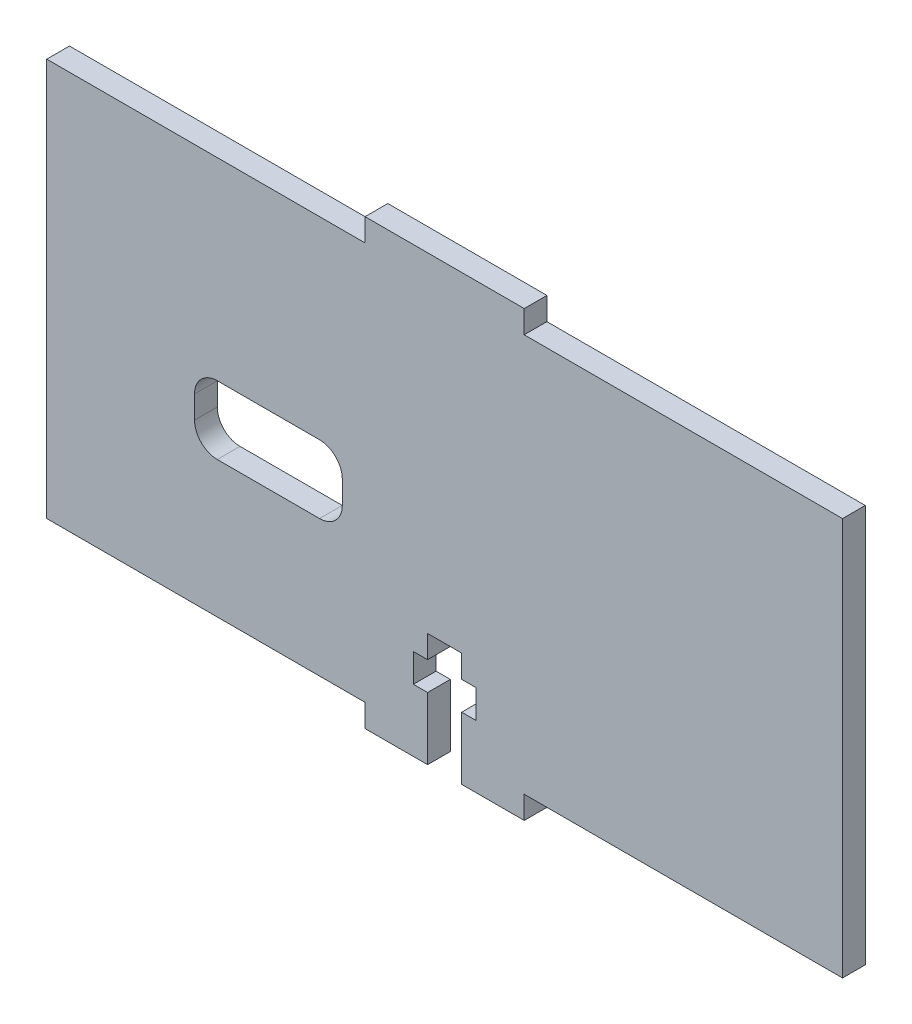
ISO-10303-21;
HEADER;
FILE_DESCRIPTION(('STEP AP214'),'2;1');
FILE_NAME('part.step','',(''),(''),'','','');
FILE_SCHEMA(('AUTOMOTIVE_DESIGN { 1 0 10303 214 1 1 1 1 }'));
ENDSEC;
DATA;
#1=APPLICATION_CONTEXT('core data for automotive mechanical design processes');
#2=APPLICATION_PROTOCOL_DEFINITION('international standard','automotive_design',2000,#1);
#3=PRODUCT_CONTEXT('',#1,'mechanical');
#4=PRODUCT('Part','Part','',(#3));
#5=PRODUCT_RELATED_PRODUCT_CATEGORY('part','',(#4));
#6=PRODUCT_DEFINITION_FORMATION('','',#4);
#7=PRODUCT_DEFINITION_CONTEXT('part definition',#1,'design');
#8=PRODUCT_DEFINITION('design','',#6,#7);
#9=PRODUCT_DEFINITION_SHAPE('','',#8);
#10=(LENGTH_UNIT() NAMED_UNIT(*) SI_UNIT(.MILLI.,.METRE.));
#11=(NAMED_UNIT(*) PLANE_ANGLE_UNIT() SI_UNIT($,.RADIAN.));
#12=(NAMED_UNIT(*) SI_UNIT($,.STERADIAN.) SOLID_ANGLE_UNIT());
#13=UNCERTAINTY_MEASURE_WITH_UNIT(LENGTH_MEASURE(1.E-05),#10,'distance_accuracy_value','');
#14=(GEOMETRIC_REPRESENTATION_CONTEXT(3) GLOBAL_UNCERTAINTY_ASSIGNED_CONTEXT((#13)) GLOBAL_UNIT_ASSIGNED_CONTEXT((#10,
#11,#12)) REPRESENTATION_CONTEXT('',''));
#15=CARTESIAN_POINT('',(0.,0.,0.));
#16=DIRECTION('',(0.,0.,1.));
#17=DIRECTION('',(1.,0.,0.));
#18=AXIS2_PLACEMENT_3D('',#15,#16,#17);
#19=CARTESIAN_POINT('',(0.,0.,2.));
#20=DIRECTION('',(0.,0.,-1.));
#21=DIRECTION('',(-1.,0.,0.));
#22=AXIS2_PLACEMENT_3D('',#19,#20,#21);
#23=PLANE('',#22);
#24=DIRECTION('',(0.,-1.,0.));
#25=VECTOR('',#24,1.);
#26=CARTESIAN_POINT('',(0.,0.,2.));
#27=LINE('',#26,#25);
#28=CARTESIAN_POINT('',(0.,35.,2.));
#29=VERTEX_POINT('',#28);
#30=CARTESIAN_POINT('',(0.,0.,2.));
#31=VERTEX_POINT('',#30);
#32=EDGE_CURVE('E253',#29,#31,#27,.T.);
#33=ORIENTED_EDGE('',*,*,#32,.T.);
#34=DIRECTION('',(1.,0.,0.));
#35=VECTOR('',#34,1.);
#36=CARTESIAN_POINT('',(0.,0.,2.));
#37=LINE('',#36,#35);
#38=CARTESIAN_POINT('',(28.,0.,2.));
#39=VERTEX_POINT('',#38);
#40=EDGE_CURVE('E242',#31,#39,#37,.T.);
#41=ORIENTED_EDGE('',*,*,#40,.T.);
#42=DIRECTION('',(0.,-1.,0.));
#43=VECTOR('',#42,1.);
#44=CARTESIAN_POINT('',(28.,0.,2.));
#45=LINE('',#44,#43);
#46=CARTESIAN_POINT('',(28.,-2.,2.));
#47=VERTEX_POINT('',#46);
#48=EDGE_CURVE('E252',#39,#47,#45,.T.);
#49=ORIENTED_EDGE('',*,*,#48,.T.);
#50=DIRECTION('',(1.,0.,0.));
#51=VECTOR('',#50,1.);
#52=CARTESIAN_POINT('',(28.,-2.,2.));
#53=LINE('',#52,#51);
#54=CARTESIAN_POINT('',(33.5,-2.,2.));
#55=VERTEX_POINT('',#54);
#56=EDGE_CURVE('E337',#47,#55,#53,.T.);
#57=ORIENTED_EDGE('',*,*,#56,.T.);
#58=DIRECTION('',(0.,1.,0.));
#59=VECTOR('',#58,1.);
#60=CARTESIAN_POINT('',(33.5,-2.,2.));
#61=LINE('',#60,#59);
#62=CARTESIAN_POINT('',(33.5,3.5,2.));
#63=VERTEX_POINT('',#62);
#64=EDGE_CURVE('E339',#55,#63,#61,.T.);
#65=ORIENTED_EDGE('',*,*,#64,.T.);
#66=DIRECTION('',(-1.,0.,0.));
#67=VECTOR('',#66,1.);
#68=CARTESIAN_POINT('',(33.5,3.5,2.));
#69=LINE('',#68,#67);
#70=CARTESIAN_POINT('',(32.25,3.5,2.));
#71=VERTEX_POINT('',#70);
#72=EDGE_CURVE('E341',#63,#71,#69,.T.);
#73=ORIENTED_EDGE('',*,*,#72,.T.);
#74=DIRECTION('',(0.,1.,0.));
#75=VECTOR('',#74,1.);
#76=CARTESIAN_POINT('',(32.25,3.5,2.));
#77=LINE('',#76,#75);
#78=CARTESIAN_POINT('',(32.25,6.,2.));
#79=VERTEX_POINT('',#78);
#80=EDGE_CURVE('E343',#71,#79,#77,.T.);
#81=ORIENTED_EDGE('',*,*,#80,.T.);
#82=DIRECTION('',(1.,0.,0.));
#83=VECTOR('',#82,1.);
#84=CARTESIAN_POINT('',(32.25,6.,2.));
#85=LINE('',#84,#83);
#86=CARTESIAN_POINT('',(33.5,6.,2.));
#87=VERTEX_POINT('',#86);
#88=EDGE_CURVE('E345',#79,#87,#85,.T.);
#89=ORIENTED_EDGE('',*,*,#88,.T.);
#90=DIRECTION('',(0.,1.,0.));
#91=VECTOR('',#90,1.);
#92=CARTESIAN_POINT('',(33.5,6.,2.));
#93=LINE('',#92,#91);
#94=CARTESIAN_POINT('',(33.5,8.,2.));
#95=VERTEX_POINT('',#94);
#96=EDGE_CURVE('E347',#87,#95,#93,.T.);
#97=ORIENTED_EDGE('',*,*,#96,.T.);
#98=DIRECTION('',(1.,0.,0.));
#99=VECTOR('',#98,1.);
#100=CARTESIAN_POINT('',(33.5,8.,2.));
#101=LINE('',#100,#99);
#102=CARTESIAN_POINT('',(36.5,8.,2.));
#103=VERTEX_POINT('',#102);
#104=EDGE_CURVE('E349',#95,#103,#101,.T.);
#105=ORIENTED_EDGE('',*,*,#104,.T.);
#106=DIRECTION('',(0.,-1.,0.));
#107=VECTOR('',#106,1.);
#108=CARTESIAN_POINT('',(36.5,8.,2.));
#109=LINE('',#108,#107);
#110=CARTESIAN_POINT('',(36.5,6.,2.));
#111=VERTEX_POINT('',#110);
#112=EDGE_CURVE('E351',#103,#111,#109,.T.);
#113=ORIENTED_EDGE('',*,*,#112,.T.);
#114=DIRECTION('',(1.,0.,0.));
#115=VECTOR('',#114,1.);
#116=CARTESIAN_POINT('',(36.5,6.,2.));
#117=LINE('',#116,#115);
#118=CARTESIAN_POINT('',(37.75,6.,2.));
#119=VERTEX_POINT('',#118);
#120=EDGE_CURVE('E353',#111,#119,#117,.T.);
#121=ORIENTED_EDGE('',*,*,#120,.T.);
#122=DIRECTION('',(0.,-1.,0.));
#123=VECTOR('',#122,1.);
#124=CARTESIAN_POINT('',(37.75,6.,2.));
#125=LINE('',#124,#123);
#126=CARTESIAN_POINT('',(37.75,3.5,2.));
#127=VERTEX_POINT('',#126);
#128=EDGE_CURVE('E355',#119,#127,#125,.T.);
#129=ORIENTED_EDGE('',*,*,#128,.T.);
#130=DIRECTION('',(-1.,0.,0.));
#131=VECTOR('',#130,1.);
#132=CARTESIAN_POINT('',(37.75,3.5,2.));
#133=LINE('',#132,#131);
#134=CARTESIAN_POINT('',(36.5,3.5,2.));
#135=VERTEX_POINT('',#134);
#136=EDGE_CURVE('E357',#127,#135,#133,.T.);
#137=ORIENTED_EDGE('',*,*,#136,.T.);
#138=DIRECTION('',(0.,-1.,0.));
#139=VECTOR('',#138,1.);
#140=CARTESIAN_POINT('',(36.5,3.5,2.));
#141=LINE('',#140,#139);
#142=CARTESIAN_POINT('',(36.5,-2.,2.));
#143=VERTEX_POINT('',#142);
#144=EDGE_CURVE('E359',#135,#143,#141,.T.);
#145=ORIENTED_EDGE('',*,*,#144,.T.);
#146=DIRECTION('',(1.,0.,0.));
#147=VECTOR('',#146,1.);
#148=CARTESIAN_POINT('',(36.5,-2.,2.));
#149=LINE('',#148,#147);
#150=CARTESIAN_POINT('',(42.,-2.,2.));
#151=VERTEX_POINT('',#150);
#152=EDGE_CURVE('E361',#143,#151,#149,.T.);
#153=ORIENTED_EDGE('',*,*,#152,.T.);
#154=DIRECTION('',(0.,1.,0.));
#155=VECTOR('',#154,1.);
#156=CARTESIAN_POINT('',(42.,0.,2.));
#157=LINE('',#156,#155);
#158=CARTESIAN_POINT('',(42.,0.,2.));
#159=VERTEX_POINT('',#158);
#160=EDGE_CURVE('E363',#151,#159,#157,.T.);
#161=ORIENTED_EDGE('',*,*,#160,.T.);
#162=DIRECTION('',(1.,0.,0.));
#163=VECTOR('',#162,1.);
#164=CARTESIAN_POINT('',(42.,0.,2.));
#165=LINE('',#164,#163);
#166=CARTESIAN_POINT('',(70.,0.,2.));
#167=VERTEX_POINT('',#166);
#168=EDGE_CURVE('E365',#159,#167,#165,.T.);
#169=ORIENTED_EDGE('',*,*,#168,.T.);
#170=DIRECTION('',(0.,1.,0.));
#171=VECTOR('',#170,1.);
#172=CARTESIAN_POINT('',(70.,0.,2.));
#173=LINE('',#172,#171);
#174=CARTESIAN_POINT('',(70.,35.,2.));
#175=VERTEX_POINT('',#174);
#176=EDGE_CURVE('E367',#167,#175,#173,.T.);
#177=ORIENTED_EDGE('',*,*,#176,.T.);
#178=DIRECTION('',(-1.,0.,0.));
#179=VECTOR('',#178,1.);
#180=CARTESIAN_POINT('',(42.,35.,2.));
#181=LINE('',#180,#179);
#182=CARTESIAN_POINT('',(42.,35.,2.));
#183=VERTEX_POINT('',#182);
#184=EDGE_CURVE('E369',#175,#183,#181,.T.);
#185=ORIENTED_EDGE('',*,*,#184,.T.);
#186=DIRECTION('',(0.,1.,0.));
#187=VECTOR('',#186,1.);
#188=CARTESIAN_POINT('',(42.,35.,2.));
#189=LINE('',#188,#187);
#190=CARTESIAN_POINT('',(42.,37.,2.));
#191=VERTEX_POINT('',#190);
#192=EDGE_CURVE('E371',#183,#191,#189,.T.);
#193=ORIENTED_EDGE('',*,*,#192,.T.);
#194=DIRECTION('',(-1.,0.,0.));
#195=VECTOR('',#194,1.);
#196=CARTESIAN_POINT('',(28.,37.,2.));
#197=LINE('',#196,#195);
#198=CARTESIAN_POINT('',(28.,37.,2.));
#199=VERTEX_POINT('',#198);
#200=EDGE_CURVE('E373',#191,#199,#197,.T.);
#201=ORIENTED_EDGE('',*,*,#200,.T.);
#202=DIRECTION('',(0.,-1.,0.));
#203=VECTOR('',#202,1.);
#204=CARTESIAN_POINT('',(28.,35.,2.));
#205=LINE('',#204,#203);
#206=CARTESIAN_POINT('',(28.,35.,2.));
#207=VERTEX_POINT('',#206);
#208=EDGE_CURVE('E375',#199,#207,#205,.T.);
#209=ORIENTED_EDGE('',*,*,#208,.T.);
#210=DIRECTION('',(-1.,0.,0.));
#211=VECTOR('',#210,1.);
#212=CARTESIAN_POINT('',(0.,35.,2.));
#213=LINE('',#212,#211);
#214=EDGE_CURVE('E257',#207,#29,#213,.T.);
#215=ORIENTED_EDGE('',*,*,#214,.T.);
#216=EDGE_LOOP('',(#33,#41,#49,#57,#65,#73,#81,#89,#97,#105,#113,#121,#129,#137,#145,#153,#161,
#169,#177,#185,#193,#201,#209,#215));
#217=FACE_BOUND('',#216,.T.);
#218=DIRECTION('',(0.,1.,0.));
#219=VECTOR('',#218,1.);
#220=CARTESIAN_POINT('',(26.,18.,2.));
#221=LINE('',#220,#219);
#222=CARTESIAN_POINT('',(26.,14.,2.));
#223=VERTEX_POINT('',#222);
#224=CARTESIAN_POINT('',(26.,16.,2.));
#225=VERTEX_POINT('',#224);
#226=EDGE_CURVE('E321',#223,#225,#221,.T.);
#227=ORIENTED_EDGE('',*,*,#226,.F.);
#228=CARTESIAN_POINT('',(24.,14.,2.));
#229=DIRECTION('',(0.,0.,-1.));
#230=DIRECTION('',(-1.,0.,0.));
#231=AXIS2_PLACEMENT_3D('',#228,#229,#230);
#232=CIRCLE('',#231,2.);
#233=CARTESIAN_POINT('',(24.,12.,2.));
#234=VERTEX_POINT('',#233);
#235=EDGE_CURVE('E296',#223,#234,#232,.T.);
#236=ORIENTED_EDGE('',*,*,#235,.T.);
#237=DIRECTION('',(1.,0.,0.));
#238=VECTOR('',#237,1.);
#239=CARTESIAN_POINT('',(13.,12.,2.));
#240=LINE('',#239,#238);
#241=CARTESIAN_POINT('',(15.,12.,2.));
#242=VERTEX_POINT('',#241);
#243=EDGE_CURVE('E323',#242,#234,#240,.T.);
#244=ORIENTED_EDGE('',*,*,#243,.F.);
#245=CARTESIAN_POINT('',(15.,14.,2.));
#246=DIRECTION('',(0.,0.,-1.));
#247=DIRECTION('',(-1.,0.,0.));
#248=AXIS2_PLACEMENT_3D('',#245,#246,#247);
#249=CIRCLE('',#248,2.);
#250=CARTESIAN_POINT('',(13.,14.,2.));
#251=VERTEX_POINT('',#250);
#252=EDGE_CURVE('E292',#242,#251,#249,.T.);
#253=ORIENTED_EDGE('',*,*,#252,.T.);
#254=DIRECTION('',(0.,-1.,0.));
#255=VECTOR('',#254,1.);
#256=CARTESIAN_POINT('',(13.,18.,2.));
#257=LINE('',#256,#255);
#258=CARTESIAN_POINT('',(13.,16.,2.));
#259=VERTEX_POINT('',#258);
#260=EDGE_CURVE('E320',#259,#251,#257,.T.);
#261=ORIENTED_EDGE('',*,*,#260,.F.);
#262=CARTESIAN_POINT('',(15.,16.,2.));
#263=DIRECTION('',(0.,0.,-1.));
#264=DIRECTION('',(-1.,0.,0.));
#265=AXIS2_PLACEMENT_3D('',#262,#263,#264);
#266=CIRCLE('',#265,2.);
#267=CARTESIAN_POINT('',(15.,18.,2.));
#268=VERTEX_POINT('',#267);
#269=EDGE_CURVE('E11',#259,#268,#266,.T.);
#270=ORIENTED_EDGE('',*,*,#269,.T.);
#271=DIRECTION('',(-1.,0.,0.));
#272=VECTOR('',#271,1.);
#273=CARTESIAN_POINT('',(13.,18.,2.));
#274=LINE('',#273,#272);
#275=CARTESIAN_POINT('',(24.,18.,2.));
#276=VERTEX_POINT('',#275);
#277=EDGE_CURVE('E318',#276,#268,#274,.T.);
#278=ORIENTED_EDGE('',*,*,#277,.F.);
#279=CARTESIAN_POINT('',(24.,16.,2.));
#280=DIRECTION('',(0.,0.,-1.));
#281=DIRECTION('',(-1.,0.,0.));
#282=AXIS2_PLACEMENT_3D('',#279,#280,#281);
#283=CIRCLE('',#282,2.);
#284=EDGE_CURVE('E300',#276,#225,#283,.T.);
#285=ORIENTED_EDGE('',*,*,#284,.T.);
#286=EDGE_LOOP('',(#227,#236,#244,#253,#261,#270,#278,#285));
#287=FACE_BOUND('',#286,.T.);
#288=ADVANCED_FACE('F33',(#217,#287),#23,.F.);
#289=CARTESIAN_POINT('',(0.,0.,0.));
#290=DIRECTION('',(0.,0.,-1.));
#291=DIRECTION('',(-1.,0.,0.));
#292=AXIS2_PLACEMENT_3D('',#289,#290,#291);
#293=PLANE('',#292);
#294=DIRECTION('',(0.,-1.,0.));
#295=VECTOR('',#294,1.);
#296=CARTESIAN_POINT('',(0.,0.,0.));
#297=LINE('',#296,#295);
#298=CARTESIAN_POINT('',(0.,35.,0.));
#299=VERTEX_POINT('',#298);
#300=CARTESIAN_POINT('',(0.,0.,0.));
#301=VERTEX_POINT('',#300);
#302=EDGE_CURVE('E265',#299,#301,#297,.T.);
#303=ORIENTED_EDGE('',*,*,#302,.F.);
#304=DIRECTION('',(-1.,0.,0.));
#305=VECTOR('',#304,1.);
#306=CARTESIAN_POINT('',(0.,35.,0.));
#307=LINE('',#306,#305);
#308=CARTESIAN_POINT('',(28.,35.,0.));
#309=VERTEX_POINT('',#308);
#310=EDGE_CURVE('E261',#309,#299,#307,.T.);
#311=ORIENTED_EDGE('',*,*,#310,.F.);
#312=DIRECTION('',(0.,-1.,0.));
#313=VECTOR('',#312,1.);
#314=CARTESIAN_POINT('',(28.,35.,0.));
#315=LINE('',#314,#313);
#316=CARTESIAN_POINT('',(28.,37.,0.));
#317=VERTEX_POINT('',#316);
#318=EDGE_CURVE('E422',#317,#309,#315,.T.);
#319=ORIENTED_EDGE('',*,*,#318,.F.);
#320=DIRECTION('',(-1.,0.,0.));
#321=VECTOR('',#320,1.);
#322=CARTESIAN_POINT('',(28.,37.,0.));
#323=LINE('',#322,#321);
#324=CARTESIAN_POINT('',(42.,37.,0.));
#325=VERTEX_POINT('',#324);
#326=EDGE_CURVE('E420',#325,#317,#323,.T.);
#327=ORIENTED_EDGE('',*,*,#326,.F.);
#328=DIRECTION('',(0.,1.,0.));
#329=VECTOR('',#328,1.);
#330=CARTESIAN_POINT('',(42.,35.,0.));
#331=LINE('',#330,#329);
#332=CARTESIAN_POINT('',(42.,35.,0.));
#333=VERTEX_POINT('',#332);
#334=EDGE_CURVE('E418',#333,#325,#331,.T.);
#335=ORIENTED_EDGE('',*,*,#334,.F.);
#336=DIRECTION('',(-1.,0.,0.));
#337=VECTOR('',#336,1.);
#338=CARTESIAN_POINT('',(42.,35.,0.));
#339=LINE('',#338,#337);
#340=CARTESIAN_POINT('',(70.,35.,0.));
#341=VERTEX_POINT('',#340);
#342=EDGE_CURVE('E416',#341,#333,#339,.T.);
#343=ORIENTED_EDGE('',*,*,#342,.F.);
#344=DIRECTION('',(0.,1.,0.));
#345=VECTOR('',#344,1.);
#346=CARTESIAN_POINT('',(70.,0.,0.));
#347=LINE('',#346,#345);
#348=CARTESIAN_POINT('',(70.,0.,0.));
#349=VERTEX_POINT('',#348);
#350=EDGE_CURVE('E414',#349,#341,#347,.T.);
#351=ORIENTED_EDGE('',*,*,#350,.F.);
#352=DIRECTION('',(1.,0.,0.));
#353=VECTOR('',#352,1.);
#354=CARTESIAN_POINT('',(42.,0.,0.));
#355=LINE('',#354,#353);
#356=CARTESIAN_POINT('',(42.,0.,0.));
#357=VERTEX_POINT('',#356);
#358=EDGE_CURVE('E412',#357,#349,#355,.T.);
#359=ORIENTED_EDGE('',*,*,#358,.F.);
#360=DIRECTION('',(0.,1.,0.));
#361=VECTOR('',#360,1.);
#362=CARTESIAN_POINT('',(42.,0.,0.));
#363=LINE('',#362,#361);
#364=CARTESIAN_POINT('',(42.,-2.,0.));
#365=VERTEX_POINT('',#364);
#366=EDGE_CURVE('E410',#365,#357,#363,.T.);
#367=ORIENTED_EDGE('',*,*,#366,.F.);
#368=DIRECTION('',(1.,0.,0.));
#369=VECTOR('',#368,1.);
#370=CARTESIAN_POINT('',(36.5,-2.,0.));
#371=LINE('',#370,#369);
#372=CARTESIAN_POINT('',(36.5,-2.,0.));
#373=VERTEX_POINT('',#372);
#374=EDGE_CURVE('E408',#373,#365,#371,.T.);
#375=ORIENTED_EDGE('',*,*,#374,.F.);
#376=DIRECTION('',(0.,-1.,0.));
#377=VECTOR('',#376,1.);
#378=CARTESIAN_POINT('',(36.5,3.5,0.));
#379=LINE('',#378,#377);
#380=CARTESIAN_POINT('',(36.5,3.5,0.));
#381=VERTEX_POINT('',#380);
#382=EDGE_CURVE('E406',#381,#373,#379,.T.);
#383=ORIENTED_EDGE('',*,*,#382,.F.);
#384=DIRECTION('',(-1.,0.,0.));
#385=VECTOR('',#384,1.);
#386=CARTESIAN_POINT('',(37.75,3.5,0.));
#387=LINE('',#386,#385);
#388=CARTESIAN_POINT('',(37.75,3.5,0.));
#389=VERTEX_POINT('',#388);
#390=EDGE_CURVE('E404',#389,#381,#387,.T.);
#391=ORIENTED_EDGE('',*,*,#390,.F.);
#392=DIRECTION('',(0.,-1.,0.));
#393=VECTOR('',#392,1.);
#394=CARTESIAN_POINT('',(37.75,6.,0.));
#395=LINE('',#394,#393);
#396=CARTESIAN_POINT('',(37.75,6.,0.));
#397=VERTEX_POINT('',#396);
#398=EDGE_CURVE('E402',#397,#389,#395,.T.);
#399=ORIENTED_EDGE('',*,*,#398,.F.);
#400=DIRECTION('',(1.,0.,0.));
#401=VECTOR('',#400,1.);
#402=CARTESIAN_POINT('',(36.5,6.,0.));
#403=LINE('',#402,#401);
#404=CARTESIAN_POINT('',(36.5,6.,0.));
#405=VERTEX_POINT('',#404);
#406=EDGE_CURVE('E400',#405,#397,#403,.T.);
#407=ORIENTED_EDGE('',*,*,#406,.F.);
#408=DIRECTION('',(0.,-1.,0.));
#409=VECTOR('',#408,1.);
#410=CARTESIAN_POINT('',(36.5,8.,0.));
#411=LINE('',#410,#409);
#412=CARTESIAN_POINT('',(36.5,8.,0.));
#413=VERTEX_POINT('',#412);
#414=EDGE_CURVE('E398',#413,#405,#411,.T.);
#415=ORIENTED_EDGE('',*,*,#414,.F.);
#416=DIRECTION('',(1.,0.,0.));
#417=VECTOR('',#416,1.);
#418=CARTESIAN_POINT('',(33.5,8.,0.));
#419=LINE('',#418,#417);
#420=CARTESIAN_POINT('',(33.5,8.,0.));
#421=VERTEX_POINT('',#420);
#422=EDGE_CURVE('E396',#421,#413,#419,.T.);
#423=ORIENTED_EDGE('',*,*,#422,.F.);
#424=DIRECTION('',(0.,1.,0.));
#425=VECTOR('',#424,1.);
#426=CARTESIAN_POINT('',(33.5,6.,0.));
#427=LINE('',#426,#425);
#428=CARTESIAN_POINT('',(33.5,6.,0.));
#429=VERTEX_POINT('',#428);
#430=EDGE_CURVE('E394',#429,#421,#427,.T.);
#431=ORIENTED_EDGE('',*,*,#430,.F.);
#432=DIRECTION('',(1.,0.,0.));
#433=VECTOR('',#432,1.);
#434=CARTESIAN_POINT('',(32.25,6.,0.));
#435=LINE('',#434,#433);
#436=CARTESIAN_POINT('',(32.25,6.,0.));
#437=VERTEX_POINT('',#436);
#438=EDGE_CURVE('E392',#437,#429,#435,.T.);
#439=ORIENTED_EDGE('',*,*,#438,.F.);
#440=DIRECTION('',(0.,1.,0.));
#441=VECTOR('',#440,1.);
#442=CARTESIAN_POINT('',(32.25,3.5,0.));
#443=LINE('',#442,#441);
#444=CARTESIAN_POINT('',(32.25,3.5,0.));
#445=VERTEX_POINT('',#444);
#446=EDGE_CURVE('E390',#445,#437,#443,.T.);
#447=ORIENTED_EDGE('',*,*,#446,.F.);
#448=DIRECTION('',(-1.,0.,0.));
#449=VECTOR('',#448,1.);
#450=CARTESIAN_POINT('',(33.5,3.5,0.));
#451=LINE('',#450,#449);
#452=CARTESIAN_POINT('',(33.5,3.5,0.));
#453=VERTEX_POINT('',#452);
#454=EDGE_CURVE('E388',#453,#445,#451,.T.);
#455=ORIENTED_EDGE('',*,*,#454,.F.);
#456=DIRECTION('',(0.,1.,0.));
#457=VECTOR('',#456,1.);
#458=CARTESIAN_POINT('',(33.5,-2.,0.));
#459=LINE('',#458,#457);
#460=CARTESIAN_POINT('',(33.5,-2.,0.));
#461=VERTEX_POINT('',#460);
#462=EDGE_CURVE('E386',#461,#453,#459,.T.);
#463=ORIENTED_EDGE('',*,*,#462,.F.);
#464=DIRECTION('',(1.,0.,0.));
#465=VECTOR('',#464,1.);
#466=CARTESIAN_POINT('',(28.,-2.,0.));
#467=LINE('',#466,#465);
#468=CARTESIAN_POINT('',(28.,-2.,0.));
#469=VERTEX_POINT('',#468);
#470=EDGE_CURVE('E384',#469,#461,#467,.T.);
#471=ORIENTED_EDGE('',*,*,#470,.F.);
#472=DIRECTION('',(0.,-1.,0.));
#473=VECTOR('',#472,1.);
#474=CARTESIAN_POINT('',(28.,0.,0.));
#475=LINE('',#474,#473);
#476=CARTESIAN_POINT('',(28.,0.,0.));
#477=VERTEX_POINT('',#476);
#478=EDGE_CURVE('E382',#477,#469,#475,.T.);
#479=ORIENTED_EDGE('',*,*,#478,.F.);
#480=DIRECTION('',(1.,0.,0.));
#481=VECTOR('',#480,1.);
#482=CARTESIAN_POINT('',(0.,0.,0.));
#483=LINE('',#482,#481);
#484=EDGE_CURVE('E380',#301,#477,#483,.T.);
#485=ORIENTED_EDGE('',*,*,#484,.F.);
#486=EDGE_LOOP('',(#303,#311,#319,#327,#335,#343,#351,#359,#367,#375,#383,#391,#399,#407,#415,
#423,#431,#439,#447,#455,#463,#471,#479,#485));
#487=FACE_BOUND('',#486,.T.);
#488=DIRECTION('',(0.,-1.,0.));
#489=VECTOR('',#488,1.);
#490=CARTESIAN_POINT('',(13.,18.,0.));
#491=LINE('',#490,#489);
#492=CARTESIAN_POINT('',(13.,16.,0.));
#493=VERTEX_POINT('',#492);
#494=CARTESIAN_POINT('',(13.,14.,0.));
#495=VERTEX_POINT('',#494);
#496=EDGE_CURVE('E306',#493,#495,#491,.T.);
#497=ORIENTED_EDGE('',*,*,#496,.T.);
#498=CARTESIAN_POINT('',(15.,14.,0.));
#499=DIRECTION('',(0.,0.,-1.));
#500=DIRECTION('',(-1.,0.,0.));
#501=AXIS2_PLACEMENT_3D('',#498,#499,#500);
#502=CIRCLE('',#501,2.);
#503=CARTESIAN_POINT('',(15.,12.,0.));
#504=VERTEX_POINT('',#503);
#505=EDGE_CURVE('E290',#495,#504,#502,.F.);
#506=ORIENTED_EDGE('',*,*,#505,.T.);
#507=DIRECTION('',(1.,0.,0.));
#508=VECTOR('',#507,1.);
#509=CARTESIAN_POINT('',(13.,12.,0.));
#510=LINE('',#509,#508);
#511=CARTESIAN_POINT('',(24.,12.,0.));
#512=VERTEX_POINT('',#511);
#513=EDGE_CURVE('E315',#504,#512,#510,.T.);
#514=ORIENTED_EDGE('',*,*,#513,.T.);
#515=CARTESIAN_POINT('',(24.,14.,0.));
#516=DIRECTION('',(0.,0.,-1.));
#517=DIRECTION('',(-1.,0.,0.));
#518=AXIS2_PLACEMENT_3D('',#515,#516,#517);
#519=CIRCLE('',#518,2.);
#520=CARTESIAN_POINT('',(26.,14.,0.));
#521=VERTEX_POINT('',#520);
#522=EDGE_CURVE('E294',#512,#521,#519,.F.);
#523=ORIENTED_EDGE('',*,*,#522,.T.);
#524=DIRECTION('',(0.,1.,0.));
#525=VECTOR('',#524,1.);
#526=CARTESIAN_POINT('',(26.,18.,0.));
#527=LINE('',#526,#525);
#528=CARTESIAN_POINT('',(26.,16.,0.));
#529=VERTEX_POINT('',#528);
#530=EDGE_CURVE('E330',#521,#529,#527,.T.);
#531=ORIENTED_EDGE('',*,*,#530,.T.);
#532=CARTESIAN_POINT('',(24.,16.,0.));
#533=DIRECTION('',(0.,0.,-1.));
#534=DIRECTION('',(-1.,0.,0.));
#535=AXIS2_PLACEMENT_3D('',#532,#533,#534);
#536=CIRCLE('',#535,2.);
#537=CARTESIAN_POINT('',(24.,18.,0.));
#538=VERTEX_POINT('',#537);
#539=EDGE_CURVE('E298',#529,#538,#536,.F.);
#540=ORIENTED_EDGE('',*,*,#539,.T.);
#541=DIRECTION('',(-1.,0.,0.));
#542=VECTOR('',#541,1.);
#543=CARTESIAN_POINT('',(13.,18.,0.));
#544=LINE('',#543,#542);
#545=CARTESIAN_POINT('',(15.,18.,0.));
#546=VERTEX_POINT('',#545);
#547=EDGE_CURVE('E307',#538,#546,#544,.T.);
#548=ORIENTED_EDGE('',*,*,#547,.T.);
#549=CARTESIAN_POINT('',(15.,16.,0.));
#550=DIRECTION('',(0.,0.,-1.));
#551=DIRECTION('',(-1.,0.,0.));
#552=AXIS2_PLACEMENT_3D('',#549,#550,#551);
#553=CIRCLE('',#552,2.);
#554=EDGE_CURVE('E41',#546,#493,#553,.F.);
#555=ORIENTED_EDGE('',*,*,#554,.T.);
#556=EDGE_LOOP('',(#497,#506,#514,#523,#531,#540,#548,#555));
#557=FACE_BOUND('',#556,.T.);
#558=ADVANCED_FACE('F305',(#487,#557),#293,.T.);
#559=CARTESIAN_POINT('',(0.,0.,2.));
#560=DIRECTION('',(1.,0.,0.));
#561=DIRECTION('',(0.,0.,-1.));
#562=AXIS2_PLACEMENT_3D('',#559,#560,#561);
#563=PLANE('',#562);
#564=ORIENTED_EDGE('',*,*,#302,.T.);
#565=DIRECTION('',(0.,0.,-1.));
#566=VECTOR('',#565,1.);
#567=CARTESIAN_POINT('',(0.,0.,2.));
#568=LINE('',#567,#566);
#569=EDGE_CURVE('E246',#31,#301,#568,.T.);
#570=ORIENTED_EDGE('',*,*,#569,.F.);
#571=ORIENTED_EDGE('',*,*,#32,.F.);
#572=DIRECTION('',(0.,0.,-1.));
#573=VECTOR('',#572,1.);
#574=CARTESIAN_POINT('',(0.,35.,2.));
#575=LINE('',#574,#573);
#576=EDGE_CURVE('E378',#29,#299,#575,.T.);
#577=ORIENTED_EDGE('',*,*,#576,.T.);
#578=EDGE_LOOP('',(#564,#570,#571,#577));
#579=FACE_BOUND('',#578,.T.);
#580=ADVANCED_FACE('F263',(#579),#563,.F.);
#581=CARTESIAN_POINT('',(0.,0.,2.));
#582=DIRECTION('',(0.,1.,0.));
#583=DIRECTION('',(0.,0.,1.));
#584=AXIS2_PLACEMENT_3D('',#581,#582,#583);
#585=PLANE('',#584);
#586=ORIENTED_EDGE('',*,*,#484,.T.);
#587=DIRECTION('',(0.,0.,-1.));
#588=VECTOR('',#587,1.);
#589=CARTESIAN_POINT('',(28.,0.,2.));
#590=LINE('',#589,#588);
#591=EDGE_CURVE('E249',#39,#477,#590,.T.);
#592=ORIENTED_EDGE('',*,*,#591,.F.);
#593=ORIENTED_EDGE('',*,*,#40,.F.);
#594=ORIENTED_EDGE('',*,*,#569,.T.);
#595=EDGE_LOOP('',(#586,#592,#593,#594));
#596=FACE_BOUND('',#595,.T.);
#597=ADVANCED_FACE('F244',(#596),#585,.F.);
#598=CARTESIAN_POINT('',(28.,0.,2.));
#599=DIRECTION('',(1.,0.,0.));
#600=DIRECTION('',(0.,1.,0.));
#601=AXIS2_PLACEMENT_3D('',#598,#599,#600);
#602=PLANE('',#601);
#603=ORIENTED_EDGE('',*,*,#478,.T.);
#604=DIRECTION('',(0.,0.,-1.));
#605=VECTOR('',#604,1.);
#606=CARTESIAN_POINT('',(28.,-2.,2.));
#607=LINE('',#606,#605);
#608=EDGE_CURVE('E270',#47,#469,#607,.T.);
#609=ORIENTED_EDGE('',*,*,#608,.F.);
#610=ORIENTED_EDGE('',*,*,#48,.F.);
#611=ORIENTED_EDGE('',*,*,#591,.T.);
#612=EDGE_LOOP('',(#603,#609,#610,#611));
#613=FACE_BOUND('',#612,.T.);
#614=ADVANCED_FACE('F508',(#613),#602,.F.);
#615=CARTESIAN_POINT('',(28.,-2.,2.));
#616=DIRECTION('',(0.,1.,0.));
#617=DIRECTION('',(0.,0.,1.));
#618=AXIS2_PLACEMENT_3D('',#615,#616,#617);
#619=PLANE('',#618);
#620=ORIENTED_EDGE('',*,*,#470,.T.);
#621=DIRECTION('',(0.,0.,-1.));
#622=VECTOR('',#621,1.);
#623=CARTESIAN_POINT('',(33.5,-2.,2.));
#624=LINE('',#623,#622);
#625=EDGE_CURVE('E483',#55,#461,#624,.T.);
#626=ORIENTED_EDGE('',*,*,#625,.F.);
#627=ORIENTED_EDGE('',*,*,#56,.F.);
#628=ORIENTED_EDGE('',*,*,#608,.T.);
#629=EDGE_LOOP('',(#620,#626,#627,#628));
#630=FACE_BOUND('',#629,.T.);
#631=ADVANCED_FACE('F490',(#630),#619,.F.);
#632=CARTESIAN_POINT('',(33.5,-2.,2.));
#633=DIRECTION('',(-1.,0.,0.));
#634=DIRECTION('',(0.,-1.,0.));
#635=AXIS2_PLACEMENT_3D('',#632,#633,#634);
#636=PLANE('',#635);
#637=ORIENTED_EDGE('',*,*,#462,.T.);
#638=DIRECTION('',(0.,0.,-1.));
#639=VECTOR('',#638,1.);
#640=CARTESIAN_POINT('',(33.5,3.5,2.));
#641=LINE('',#640,#639);
#642=EDGE_CURVE('E480',#63,#453,#641,.T.);
#643=ORIENTED_EDGE('',*,*,#642,.F.);
#644=ORIENTED_EDGE('',*,*,#64,.F.);
#645=ORIENTED_EDGE('',*,*,#625,.T.);
#646=EDGE_LOOP('',(#637,#643,#644,#645));
#647=FACE_BOUND('',#646,.T.);
#648=ADVANCED_FACE('F500',(#647),#636,.F.);
#649=CARTESIAN_POINT('',(33.5,3.5,2.));
#650=DIRECTION('',(0.,-1.,0.));
#651=DIRECTION('',(1.,0.,0.));
#652=AXIS2_PLACEMENT_3D('',#649,#650,#651);
#653=PLANE('',#652);
#654=ORIENTED_EDGE('',*,*,#454,.T.);
#655=DIRECTION('',(0.,0.,-1.));
#656=VECTOR('',#655,1.);
#657=CARTESIAN_POINT('',(32.25,3.5,2.));
#658=LINE('',#657,#656);
#659=EDGE_CURVE('E477',#71,#445,#658,.T.);
#660=ORIENTED_EDGE('',*,*,#659,.F.);
#661=ORIENTED_EDGE('',*,*,#72,.F.);
#662=ORIENTED_EDGE('',*,*,#642,.T.);
#663=EDGE_LOOP('',(#654,#660,#661,#662));
#664=FACE_BOUND('',#663,.T.);
#665=ADVANCED_FACE('F504',(#664),#653,.F.);
#666=CARTESIAN_POINT('',(32.25,3.5,2.));
#667=DIRECTION('',(-1.,0.,0.));
#668=DIRECTION('',(0.,0.,1.));
#669=AXIS2_PLACEMENT_3D('',#666,#667,#668);
#670=PLANE('',#669);
#671=ORIENTED_EDGE('',*,*,#446,.T.);
#672=DIRECTION('',(0.,0.,-1.));
#673=VECTOR('',#672,1.);
#674=CARTESIAN_POINT('',(32.25,6.,2.));
#675=LINE('',#674,#673);
#676=EDGE_CURVE('E474',#79,#437,#675,.T.);
#677=ORIENTED_EDGE('',*,*,#676,.F.);
#678=ORIENTED_EDGE('',*,*,#80,.F.);
#679=ORIENTED_EDGE('',*,*,#659,.T.);
#680=EDGE_LOOP('',(#671,#677,#678,#679));
#681=FACE_BOUND('',#680,.T.);
#682=ADVANCED_FACE('F594',(#681),#670,.F.);
#683=CARTESIAN_POINT('',(32.25,6.,2.));
#684=DIRECTION('',(0.,1.,0.));
#685=DIRECTION('',(0.,0.,1.));
#686=AXIS2_PLACEMENT_3D('',#683,#684,#685);
#687=PLANE('',#686);
#688=ORIENTED_EDGE('',*,*,#438,.T.);
#689=DIRECTION('',(0.,0.,-1.));
#690=VECTOR('',#689,1.);
#691=CARTESIAN_POINT('',(33.5,6.,2.));
#692=LINE('',#691,#690);
#693=EDGE_CURVE('E471',#87,#429,#692,.T.);
#694=ORIENTED_EDGE('',*,*,#693,.F.);
#695=ORIENTED_EDGE('',*,*,#88,.F.);
#696=ORIENTED_EDGE('',*,*,#676,.T.);
#697=EDGE_LOOP('',(#688,#694,#695,#696));
#698=FACE_BOUND('',#697,.T.);
#699=ADVANCED_FACE('F590',(#698),#687,.F.);
#700=CARTESIAN_POINT('',(33.5,6.,2.));
#701=DIRECTION('',(-1.,0.,0.));
#702=DIRECTION('',(0.,-1.,0.));
#703=AXIS2_PLACEMENT_3D('',#700,#701,#702);
#704=PLANE('',#703);
#705=ORIENTED_EDGE('',*,*,#430,.T.);
#706=DIRECTION('',(0.,0.,-1.));
#707=VECTOR('',#706,1.);
#708=CARTESIAN_POINT('',(33.5,8.,2.));
#709=LINE('',#708,#707);
#710=EDGE_CURVE('E468',#95,#421,#709,.T.);
#711=ORIENTED_EDGE('',*,*,#710,.F.);
#712=ORIENTED_EDGE('',*,*,#96,.F.);
#713=ORIENTED_EDGE('',*,*,#693,.T.);
#714=EDGE_LOOP('',(#705,#711,#712,#713));
#715=FACE_BOUND('',#714,.T.);
#716=ADVANCED_FACE('F586',(#715),#704,.F.);
#717=CARTESIAN_POINT('',(33.5,8.,2.));
#718=DIRECTION('',(0.,1.,0.));
#719=DIRECTION('',(0.,0.,1.));
#720=AXIS2_PLACEMENT_3D('',#717,#718,#719);
#721=PLANE('',#720);
#722=ORIENTED_EDGE('',*,*,#422,.T.);
#723=DIRECTION('',(0.,0.,-1.));
#724=VECTOR('',#723,1.);
#725=CARTESIAN_POINT('',(36.5,8.,2.));
#726=LINE('',#725,#724);
#727=EDGE_CURVE('E465',#103,#413,#726,.T.);
#728=ORIENTED_EDGE('',*,*,#727,.F.);
#729=ORIENTED_EDGE('',*,*,#104,.F.);
#730=ORIENTED_EDGE('',*,*,#710,.T.);
#731=EDGE_LOOP('',(#722,#728,#729,#730));
#732=FACE_BOUND('',#731,.T.);
#733=ADVANCED_FACE('F582',(#732),#721,.F.);
#734=CARTESIAN_POINT('',(36.5,8.,2.));
#735=DIRECTION('',(1.,0.,0.));
#736=DIRECTION('',(0.,1.,0.));
#737=AXIS2_PLACEMENT_3D('',#734,#735,#736);
#738=PLANE('',#737);
#739=ORIENTED_EDGE('',*,*,#414,.T.);
#740=DIRECTION('',(0.,0.,-1.));
#741=VECTOR('',#740,1.);
#742=CARTESIAN_POINT('',(36.5,6.,2.));
#743=LINE('',#742,#741);
#744=EDGE_CURVE('E462',#111,#405,#743,.T.);
#745=ORIENTED_EDGE('',*,*,#744,.F.);
#746=ORIENTED_EDGE('',*,*,#112,.F.);
#747=ORIENTED_EDGE('',*,*,#727,.T.);
#748=EDGE_LOOP('',(#739,#745,#746,#747));
#749=FACE_BOUND('',#748,.T.);
#750=ADVANCED_FACE('F578',(#749),#738,.F.);
#751=CARTESIAN_POINT('',(36.5,6.,2.));
#752=DIRECTION('',(0.,1.,0.));
#753=DIRECTION('',(-1.,0.,0.));
#754=AXIS2_PLACEMENT_3D('',#751,#752,#753);
#755=PLANE('',#754);
#756=ORIENTED_EDGE('',*,*,#406,.T.);
#757=DIRECTION('',(0.,0.,-1.));
#758=VECTOR('',#757,1.);
#759=CARTESIAN_POINT('',(37.75,6.,2.));
#760=LINE('',#759,#758);
#761=EDGE_CURVE('E459',#119,#397,#760,.T.);
#762=ORIENTED_EDGE('',*,*,#761,.F.);
#763=ORIENTED_EDGE('',*,*,#120,.F.);
#764=ORIENTED_EDGE('',*,*,#744,.T.);
#765=EDGE_LOOP('',(#756,#762,#763,#764));
#766=FACE_BOUND('',#765,.T.);
#767=ADVANCED_FACE('F574',(#766),#755,.F.);
#768=CARTESIAN_POINT('',(37.75,6.,2.));
#769=DIRECTION('',(1.,0.,0.));
#770=DIRECTION('',(0.,0.,-1.));
#771=AXIS2_PLACEMENT_3D('',#768,#769,#770);
#772=PLANE('',#771);
#773=ORIENTED_EDGE('',*,*,#398,.T.);
#774=DIRECTION('',(0.,0.,-1.));
#775=VECTOR('',#774,1.);
#776=CARTESIAN_POINT('',(37.75,3.5,2.));
#777=LINE('',#776,#775);
#778=EDGE_CURVE('E456',#127,#389,#777,.T.);
#779=ORIENTED_EDGE('',*,*,#778,.F.);
#780=ORIENTED_EDGE('',*,*,#128,.F.);
#781=ORIENTED_EDGE('',*,*,#761,.T.);
#782=EDGE_LOOP('',(#773,#779,#780,#781));
#783=FACE_BOUND('',#782,.T.);
#784=ADVANCED_FACE('F570',(#783),#772,.F.);
#785=CARTESIAN_POINT('',(37.75,3.5,2.));
#786=DIRECTION('',(0.,-1.,0.));
#787=DIRECTION('',(1.,0.,0.));
#788=AXIS2_PLACEMENT_3D('',#785,#786,#787);
#789=PLANE('',#788);
#790=ORIENTED_EDGE('',*,*,#390,.T.);
#791=DIRECTION('',(0.,0.,-1.));
#792=VECTOR('',#791,1.);
#793=CARTESIAN_POINT('',(36.5,3.5,2.));
#794=LINE('',#793,#792);
#795=EDGE_CURVE('E453',#135,#381,#794,.T.);
#796=ORIENTED_EDGE('',*,*,#795,.F.);
#797=ORIENTED_EDGE('',*,*,#136,.F.);
#798=ORIENTED_EDGE('',*,*,#778,.T.);
#799=EDGE_LOOP('',(#790,#796,#797,#798));
#800=FACE_BOUND('',#799,.T.);
#801=ADVANCED_FACE('F566',(#800),#789,.F.);
#802=CARTESIAN_POINT('',(36.5,3.5,2.));
#803=DIRECTION('',(1.,0.,0.));
#804=DIRECTION('',(0.,1.,0.));
#805=AXIS2_PLACEMENT_3D('',#802,#803,#804);
#806=PLANE('',#805);
#807=ORIENTED_EDGE('',*,*,#382,.T.);
#808=DIRECTION('',(0.,0.,-1.));
#809=VECTOR('',#808,1.);
#810=CARTESIAN_POINT('',(36.5,-2.,2.));
#811=LINE('',#810,#809);
#812=EDGE_CURVE('E450',#143,#373,#811,.T.);
#813=ORIENTED_EDGE('',*,*,#812,.F.);
#814=ORIENTED_EDGE('',*,*,#144,.F.);
#815=ORIENTED_EDGE('',*,*,#795,.T.);
#816=EDGE_LOOP('',(#807,#813,#814,#815));
#817=FACE_BOUND('',#816,.T.);
#818=ADVANCED_FACE('F562',(#817),#806,.F.);
#819=CARTESIAN_POINT('',(36.5,-2.,2.));
#820=DIRECTION('',(0.,1.,0.));
#821=DIRECTION('',(0.,0.,1.));
#822=AXIS2_PLACEMENT_3D('',#819,#820,#821);
#823=PLANE('',#822);
#824=ORIENTED_EDGE('',*,*,#374,.T.);
#825=DIRECTION('',(0.,0.,-1.));
#826=VECTOR('',#825,1.);
#827=CARTESIAN_POINT('',(42.,-2.,2.));
#828=LINE('',#827,#826);
#829=EDGE_CURVE('E447',#151,#365,#828,.T.);
#830=ORIENTED_EDGE('',*,*,#829,.F.);
#831=ORIENTED_EDGE('',*,*,#152,.F.);
#832=ORIENTED_EDGE('',*,*,#812,.T.);
#833=EDGE_LOOP('',(#824,#830,#831,#832));
#834=FACE_BOUND('',#833,.T.);
#835=ADVANCED_FACE('F558',(#834),#823,.F.);
#836=CARTESIAN_POINT('',(42.,0.,2.));
#837=DIRECTION('',(-1.,0.,0.));
#838=DIRECTION('',(0.,0.,1.));
#839=AXIS2_PLACEMENT_3D('',#836,#837,#838);
#840=PLANE('',#839);
#841=ORIENTED_EDGE('',*,*,#366,.T.);
#842=DIRECTION('',(0.,0.,-1.));
#843=VECTOR('',#842,1.);
#844=CARTESIAN_POINT('',(42.,0.,2.));
#845=LINE('',#844,#843);
#846=EDGE_CURVE('E444',#159,#357,#845,.T.);
#847=ORIENTED_EDGE('',*,*,#846,.F.);
#848=ORIENTED_EDGE('',*,*,#160,.F.);
#849=ORIENTED_EDGE('',*,*,#829,.T.);
#850=EDGE_LOOP('',(#841,#847,#848,#849));
#851=FACE_BOUND('',#850,.T.);
#852=ADVANCED_FACE('F554',(#851),#840,.F.);
#853=CARTESIAN_POINT('',(42.,0.,2.));
#854=DIRECTION('',(0.,1.,0.));
#855=DIRECTION('',(0.,0.,1.));
#856=AXIS2_PLACEMENT_3D('',#853,#854,#855);
#857=PLANE('',#856);
#858=ORIENTED_EDGE('',*,*,#358,.T.);
#859=DIRECTION('',(0.,0.,-1.));
#860=VECTOR('',#859,1.);
#861=CARTESIAN_POINT('',(70.,0.,2.));
#862=LINE('',#861,#860);
#863=EDGE_CURVE('E441',#167,#349,#862,.T.);
#864=ORIENTED_EDGE('',*,*,#863,.F.);
#865=ORIENTED_EDGE('',*,*,#168,.F.);
#866=ORIENTED_EDGE('',*,*,#846,.T.);
#867=EDGE_LOOP('',(#858,#864,#865,#866));
#868=FACE_BOUND('',#867,.T.);
#869=ADVANCED_FACE('F550',(#868),#857,.F.);
#870=CARTESIAN_POINT('',(70.,0.,2.));
#871=DIRECTION('',(-1.,0.,0.));
#872=DIRECTION('',(0.,0.,1.));
#873=AXIS2_PLACEMENT_3D('',#870,#871,#872);
#874=PLANE('',#873);
#875=ORIENTED_EDGE('',*,*,#350,.T.);
#876=DIRECTION('',(0.,0.,-1.));
#877=VECTOR('',#876,1.);
#878=CARTESIAN_POINT('',(70.,35.,2.));
#879=LINE('',#878,#877);
#880=EDGE_CURVE('E438',#175,#341,#879,.T.);
#881=ORIENTED_EDGE('',*,*,#880,.F.);
#882=ORIENTED_EDGE('',*,*,#176,.F.);
#883=ORIENTED_EDGE('',*,*,#863,.T.);
#884=EDGE_LOOP('',(#875,#881,#882,#883));
#885=FACE_BOUND('',#884,.T.);
#886=ADVANCED_FACE('F546',(#885),#874,.F.);
#887=CARTESIAN_POINT('',(42.,35.,2.));
#888=DIRECTION('',(0.,-1.,0.));
#889=DIRECTION('',(0.,0.,-1.));
#890=AXIS2_PLACEMENT_3D('',#887,#888,#889);
#891=PLANE('',#890);
#892=ORIENTED_EDGE('',*,*,#342,.T.);
#893=DIRECTION('',(0.,0.,-1.));
#894=VECTOR('',#893,1.);
#895=CARTESIAN_POINT('',(42.,35.,2.));
#896=LINE('',#895,#894);
#897=EDGE_CURVE('E435',#183,#333,#896,.T.);
#898=ORIENTED_EDGE('',*,*,#897,.F.);
#899=ORIENTED_EDGE('',*,*,#184,.F.);
#900=ORIENTED_EDGE('',*,*,#880,.T.);
#901=EDGE_LOOP('',(#892,#898,#899,#900));
#902=FACE_BOUND('',#901,.T.);
#903=ADVANCED_FACE('F542',(#902),#891,.F.);
#904=CARTESIAN_POINT('',(42.,35.,2.));
#905=DIRECTION('',(-1.,0.,0.));
#906=DIRECTION('',(0.,0.,1.));
#907=AXIS2_PLACEMENT_3D('',#904,#905,#906);
#908=PLANE('',#907);
#909=ORIENTED_EDGE('',*,*,#334,.T.);
#910=DIRECTION('',(0.,0.,-1.));
#911=VECTOR('',#910,1.);
#912=CARTESIAN_POINT('',(42.,37.,2.));
#913=LINE('',#912,#911);
#914=EDGE_CURVE('E432',#191,#325,#913,.T.);
#915=ORIENTED_EDGE('',*,*,#914,.F.);
#916=ORIENTED_EDGE('',*,*,#192,.F.);
#917=ORIENTED_EDGE('',*,*,#897,.T.);
#918=EDGE_LOOP('',(#909,#915,#916,#917));
#919=FACE_BOUND('',#918,.T.);
#920=ADVANCED_FACE('F538',(#919),#908,.F.);
#921=CARTESIAN_POINT('',(28.,37.,2.));
#922=DIRECTION('',(0.,-1.,0.));
#923=DIRECTION('',(0.,0.,-1.));
#924=AXIS2_PLACEMENT_3D('',#921,#922,#923);
#925=PLANE('',#924);
#926=ORIENTED_EDGE('',*,*,#326,.T.);
#927=DIRECTION('',(0.,0.,-1.));
#928=VECTOR('',#927,1.);
#929=CARTESIAN_POINT('',(28.,37.,2.));
#930=LINE('',#929,#928);
#931=EDGE_CURVE('E429',#199,#317,#930,.T.);
#932=ORIENTED_EDGE('',*,*,#931,.F.);
#933=ORIENTED_EDGE('',*,*,#200,.F.);
#934=ORIENTED_EDGE('',*,*,#914,.T.);
#935=EDGE_LOOP('',(#926,#932,#933,#934));
#936=FACE_BOUND('',#935,.T.);
#937=ADVANCED_FACE('F534',(#936),#925,.F.);
#938=CARTESIAN_POINT('',(28.,35.,2.));
#939=DIRECTION('',(1.,0.,0.));
#940=DIRECTION('',(0.,1.,0.));
#941=AXIS2_PLACEMENT_3D('',#938,#939,#940);
#942=PLANE('',#941);
#943=ORIENTED_EDGE('',*,*,#318,.T.);
#944=DIRECTION('',(0.,0.,-1.));
#945=VECTOR('',#944,1.);
#946=CARTESIAN_POINT('',(28.,35.,2.));
#947=LINE('',#946,#945);
#948=EDGE_CURVE('E426',#207,#309,#947,.T.);
#949=ORIENTED_EDGE('',*,*,#948,.F.);
#950=ORIENTED_EDGE('',*,*,#208,.F.);
#951=ORIENTED_EDGE('',*,*,#931,.T.);
#952=EDGE_LOOP('',(#943,#949,#950,#951));
#953=FACE_BOUND('',#952,.T.);
#954=ADVANCED_FACE('F530',(#953),#942,.F.);
#955=CARTESIAN_POINT('',(0.,35.,2.));
#956=DIRECTION('',(0.,-1.,0.));
#957=DIRECTION('',(0.,0.,-1.));
#958=AXIS2_PLACEMENT_3D('',#955,#956,#957);
#959=PLANE('',#958);
#960=ORIENTED_EDGE('',*,*,#310,.T.);
#961=ORIENTED_EDGE('',*,*,#576,.F.);
#962=ORIENTED_EDGE('',*,*,#214,.F.);
#963=ORIENTED_EDGE('',*,*,#948,.T.);
#964=EDGE_LOOP('',(#960,#961,#962,#963));
#965=FACE_BOUND('',#964,.T.);
#966=ADVANCED_FACE('F527',(#965),#959,.F.);
#967=CARTESIAN_POINT('',(26.,18.,2.));
#968=DIRECTION('',(-1.,0.,0.));
#969=DIRECTION('',(0.,0.,1.));
#970=AXIS2_PLACEMENT_3D('',#967,#968,#969);
#971=PLANE('',#970);
#972=ORIENTED_EDGE('',*,*,#530,.F.);
#973=DIRECTION('',(0.,0.,-1.));
#974=VECTOR('',#973,1.);
#975=CARTESIAN_POINT('',(26.,14.,2.));
#976=LINE('',#975,#974);
#977=EDGE_CURVE('E284',#521,#223,#976,.F.);
#978=ORIENTED_EDGE('',*,*,#977,.T.);
#979=ORIENTED_EDGE('',*,*,#226,.T.);
#980=DIRECTION('',(0.,0.,-1.));
#981=VECTOR('',#980,1.);
#982=CARTESIAN_POINT('',(26.,16.,0.));
#983=LINE('',#982,#981);
#984=EDGE_CURVE('E281',#225,#529,#983,.T.);
#985=ORIENTED_EDGE('',*,*,#984,.T.);
#986=EDGE_LOOP('',(#972,#978,#979,#985));
#987=FACE_BOUND('',#986,.T.);
#988=ADVANCED_FACE('F524',(#987),#971,.T.);
#989=CARTESIAN_POINT('',(13.,18.,2.));
#990=DIRECTION('',(0.,-1.,0.));
#991=DIRECTION('',(0.,0.,-1.));
#992=AXIS2_PLACEMENT_3D('',#989,#990,#991);
#993=PLANE('',#992);
#994=ORIENTED_EDGE('',*,*,#547,.F.);
#995=DIRECTION('',(0.,0.,-1.));
#996=VECTOR('',#995,1.);
#997=CARTESIAN_POINT('',(24.,18.,2.));
#998=LINE('',#997,#996);
#999=EDGE_CURVE('E53',#538,#276,#998,.F.);
#1000=ORIENTED_EDGE('',*,*,#999,.T.);
#1001=ORIENTED_EDGE('',*,*,#277,.T.);
#1002=DIRECTION('',(0.,0.,-1.));
#1003=VECTOR('',#1002,1.);
#1004=CARTESIAN_POINT('',(15.,18.,0.));
#1005=LINE('',#1004,#1003);
#1006=EDGE_CURVE('E286',#268,#546,#1005,.T.);
#1007=ORIENTED_EDGE('',*,*,#1006,.T.);
#1008=EDGE_LOOP('',(#994,#1000,#1001,#1007));
#1009=FACE_BOUND('',#1008,.T.);
#1010=ADVANCED_FACE('F317',(#1009),#993,.T.);
#1011=CARTESIAN_POINT('',(13.,18.,2.));
#1012=DIRECTION('',(1.,0.,0.));
#1013=DIRECTION('',(0.,0.,-1.));
#1014=AXIS2_PLACEMENT_3D('',#1011,#1012,#1013);
#1015=PLANE('',#1014);
#1016=ORIENTED_EDGE('',*,*,#260,.T.);
#1017=DIRECTION('',(0.,0.,-1.));
#1018=VECTOR('',#1017,1.);
#1019=CARTESIAN_POINT('',(13.,14.,0.));
#1020=LINE('',#1019,#1018);
#1021=EDGE_CURVE('E268',#251,#495,#1020,.T.);
#1022=ORIENTED_EDGE('',*,*,#1021,.T.);
#1023=ORIENTED_EDGE('',*,*,#496,.F.);
#1024=DIRECTION('',(0.,0.,-1.));
#1025=VECTOR('',#1024,1.);
#1026=CARTESIAN_POINT('',(13.,16.,2.));
#1027=LINE('',#1026,#1025);
#1028=EDGE_CURVE('E266',#493,#259,#1027,.F.);
#1029=ORIENTED_EDGE('',*,*,#1028,.T.);
#1030=EDGE_LOOP('',(#1016,#1022,#1023,#1029));
#1031=FACE_BOUND('',#1030,.T.);
#1032=ADVANCED_FACE('F313',(#1031),#1015,.T.);
#1033=CARTESIAN_POINT('',(13.,12.,2.));
#1034=DIRECTION('',(0.,1.,0.));
#1035=DIRECTION('',(0.,0.,1.));
#1036=AXIS2_PLACEMENT_3D('',#1033,#1034,#1035);
#1037=PLANE('',#1036);
#1038=ORIENTED_EDGE('',*,*,#513,.F.);
#1039=DIRECTION('',(0.,0.,-1.));
#1040=VECTOR('',#1039,1.);
#1041=CARTESIAN_POINT('',(15.,12.,2.));
#1042=LINE('',#1041,#1040);
#1043=EDGE_CURVE('E279',#504,#242,#1042,.F.);
#1044=ORIENTED_EDGE('',*,*,#1043,.T.);
#1045=ORIENTED_EDGE('',*,*,#243,.T.);
#1046=DIRECTION('',(0.,0.,-1.));
#1047=VECTOR('',#1046,1.);
#1048=CARTESIAN_POINT('',(24.,12.,0.));
#1049=LINE('',#1048,#1047);
#1050=EDGE_CURVE('E276',#234,#512,#1049,.T.);
#1051=ORIENTED_EDGE('',*,*,#1050,.T.);
#1052=EDGE_LOOP('',(#1038,#1044,#1045,#1051));
#1053=FACE_BOUND('',#1052,.T.);
#1054=ADVANCED_FACE('F700',(#1053),#1037,.T.);
#1055=CARTESIAN_POINT('',(15.,14.,2.));
#1056=DIRECTION('',(0.,0.,1.));
#1057=DIRECTION('',(1.,0.,0.));
#1058=AXIS2_PLACEMENT_3D('',#1055,#1056,#1057);
#1059=CYLINDRICAL_SURFACE('',#1058,2.);
#1060=ORIENTED_EDGE('',*,*,#252,.F.);
#1061=ORIENTED_EDGE('',*,*,#1043,.F.);
#1062=ORIENTED_EDGE('',*,*,#505,.F.);
#1063=ORIENTED_EDGE('',*,*,#1021,.F.);
#1064=EDGE_LOOP('',(#1060,#1061,#1062,#1063));
#1065=FACE_BOUND('',#1064,.T.);
#1066=ADVANCED_FACE('F707',(#1065),#1059,.F.);
#1067=CARTESIAN_POINT('',(24.,14.,2.));
#1068=DIRECTION('',(0.,0.,1.));
#1069=DIRECTION('',(1.,0.,0.));
#1070=AXIS2_PLACEMENT_3D('',#1067,#1068,#1069);
#1071=CYLINDRICAL_SURFACE('',#1070,2.);
#1072=ORIENTED_EDGE('',*,*,#235,.F.);
#1073=ORIENTED_EDGE('',*,*,#977,.F.);
#1074=ORIENTED_EDGE('',*,*,#522,.F.);
#1075=ORIENTED_EDGE('',*,*,#1050,.F.);
#1076=EDGE_LOOP('',(#1072,#1073,#1074,#1075));
#1077=FACE_BOUND('',#1076,.T.);
#1078=ADVANCED_FACE('F715',(#1077),#1071,.F.);
#1079=CARTESIAN_POINT('',(24.,16.,2.));
#1080=DIRECTION('',(0.,0.,1.));
#1081=DIRECTION('',(1.,0.,0.));
#1082=AXIS2_PLACEMENT_3D('',#1079,#1080,#1081);
#1083=CYLINDRICAL_SURFACE('',#1082,2.);
#1084=ORIENTED_EDGE('',*,*,#284,.F.);
#1085=ORIENTED_EDGE('',*,*,#999,.F.);
#1086=ORIENTED_EDGE('',*,*,#539,.F.);
#1087=ORIENTED_EDGE('',*,*,#984,.F.);
#1088=EDGE_LOOP('',(#1084,#1085,#1086,#1087));
#1089=FACE_BOUND('',#1088,.T.);
#1090=ADVANCED_FACE('F723',(#1089),#1083,.F.);
#1091=CARTESIAN_POINT('',(15.,16.,2.));
#1092=DIRECTION('',(0.,0.,1.));
#1093=DIRECTION('',(1.,0.,0.));
#1094=AXIS2_PLACEMENT_3D('',#1091,#1092,#1093);
#1095=CYLINDRICAL_SURFACE('',#1094,2.);
#1096=ORIENTED_EDGE('',*,*,#269,.F.);
#1097=ORIENTED_EDGE('',*,*,#1028,.F.);
#1098=ORIENTED_EDGE('',*,*,#554,.F.);
#1099=ORIENTED_EDGE('',*,*,#1006,.F.);
#1100=EDGE_LOOP('',(#1096,#1097,#1098,#1099));
#1101=FACE_BOUND('',#1100,.T.);
#1102=ADVANCED_FACE('F35',(#1101),#1095,.F.);
#1103=CLOSED_SHELL('',(#288,#558,#580,#597,#614,#631,#648,#665,#682,#699,#716,#733,#750,#767,
#784,#801,#818,#835,#852,#869,#886,#903,#920,#937,#954,#966,#988,#1010,#1032,#1054,#1066,#1078,
#1090,#1102));
#1104=MANIFOLD_SOLID_BREP('B2',#1103);
#1105=ADVANCED_BREP_SHAPE_REPRESENTATION('',(#18,#1104),#14);
#1106=SHAPE_DEFINITION_REPRESENTATION(#9,#1105);
ENDSEC;
END-ISO-10303-21;
